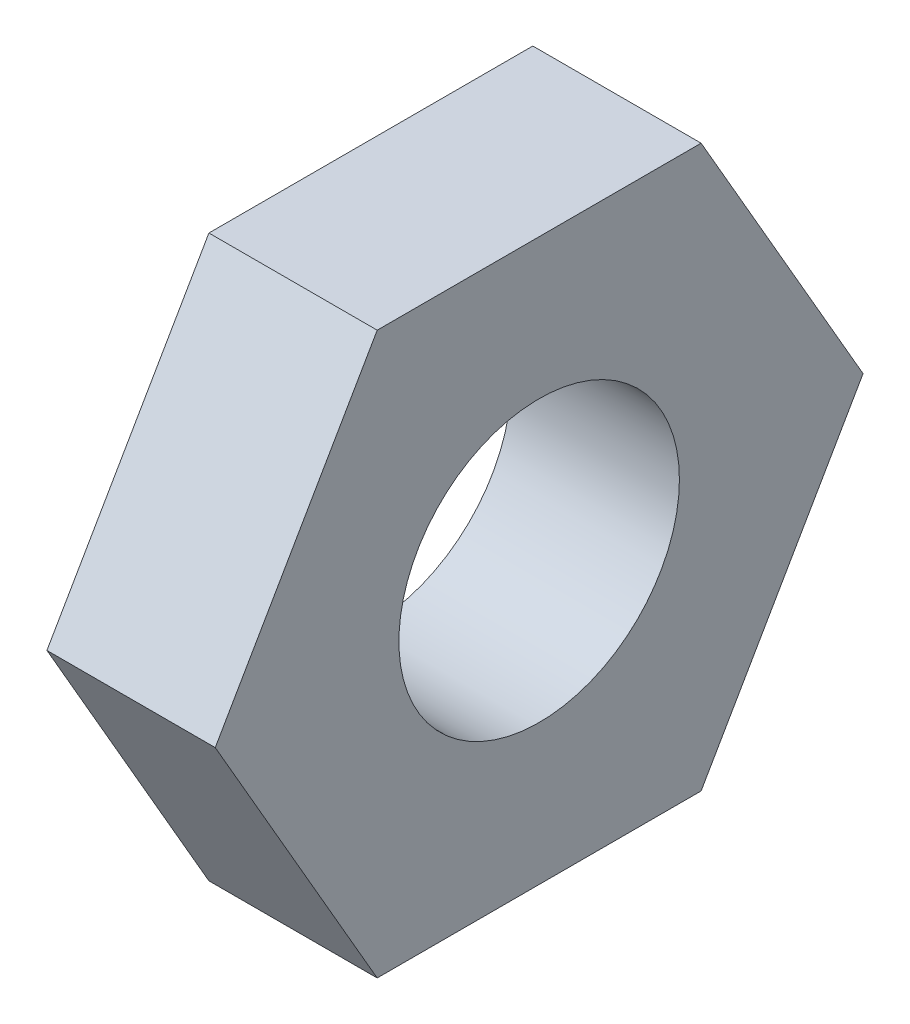
ISO-10303-21;
HEADER;
FILE_DESCRIPTION(('STEP AP214'),'2;1');
FILE_NAME('part.step','',(''),(''),'','','');
FILE_SCHEMA(('AUTOMOTIVE_DESIGN { 1 0 10303 214 1 1 1 1 }'));
ENDSEC;
DATA;
#1=APPLICATION_CONTEXT('core data for automotive mechanical design processes');
#2=APPLICATION_PROTOCOL_DEFINITION('international standard','automotive_design',2000,#1);
#3=PRODUCT_CONTEXT('',#1,'mechanical');
#4=PRODUCT('Part','Part','',(#3));
#5=PRODUCT_RELATED_PRODUCT_CATEGORY('part','',(#4));
#6=PRODUCT_DEFINITION_FORMATION('','',#4);
#7=PRODUCT_DEFINITION_CONTEXT('part definition',#1,'design');
#8=PRODUCT_DEFINITION('design','',#6,#7);
#9=PRODUCT_DEFINITION_SHAPE('','',#8);
#10=(LENGTH_UNIT() NAMED_UNIT(*) SI_UNIT(.MILLI.,.METRE.));
#11=(NAMED_UNIT(*) PLANE_ANGLE_UNIT() SI_UNIT($,.RADIAN.));
#12=(NAMED_UNIT(*) SI_UNIT($,.STERADIAN.) SOLID_ANGLE_UNIT());
#13=UNCERTAINTY_MEASURE_WITH_UNIT(LENGTH_MEASURE(1.E-05),#10,'distance_accuracy_value','');
#14=(GEOMETRIC_REPRESENTATION_CONTEXT(3) GLOBAL_UNCERTAINTY_ASSIGNED_CONTEXT((#13)) GLOBAL_UNIT_ASSIGNED_CONTEXT((#10,
#11,#12)) REPRESENTATION_CONTEXT('',''));
#15=CARTESIAN_POINT('',(0.,0.,0.));
#16=DIRECTION('',(0.,0.,1.));
#17=DIRECTION('',(1.,0.,0.));
#18=AXIS2_PLACEMENT_3D('',#15,#16,#17);
#19=CARTESIAN_POINT('',(1.5,0.,0.));
#20=DIRECTION('',(1.,0.,0.));
#21=DIRECTION('',(0.,0.,-1.));
#22=AXIS2_PLACEMENT_3D('',#19,#20,#21);
#23=PLANE('',#22);
#24=DIRECTION('',(0.,0.866025403784442,-0.499999999999995));
#25=VECTOR('',#24,1.);
#26=CARTESIAN_POINT('',(1.5,-2.49999999999997,-1.44337567297409));
#27=LINE('',#26,#25);
#28=CARTESIAN_POINT('',(1.5,-2.49999999999997,-1.44337567297409));
#29=VERTEX_POINT('',#28);
#30=CARTESIAN_POINT('',(1.5,0.,-2.88675134594812));
#31=VERTEX_POINT('',#30);
#32=EDGE_CURVE('E129',#29,#31,#27,.T.);
#33=ORIENTED_EDGE('',*,*,#32,.T.);
#34=DIRECTION('',(0.,0.866025403784438,0.500000000000001));
#35=VECTOR('',#34,1.);
#36=CARTESIAN_POINT('',(1.5,0.,-2.88675134594812));
#37=LINE('',#36,#35);
#38=CARTESIAN_POINT('',(1.5,2.49999999999999,-1.44337567297405));
#39=VERTEX_POINT('',#38);
#40=EDGE_CURVE('E87',#31,#39,#37,.T.);
#41=ORIENTED_EDGE('',*,*,#40,.T.);
#42=DIRECTION('',(0.,0.,1.));
#43=VECTOR('',#42,1.);
#44=CARTESIAN_POINT('',(1.5,2.49999999999999,-1.44337567297405));
#45=LINE('',#44,#43);
#46=CARTESIAN_POINT('',(1.5,2.49999999999998,1.44337567297407));
#47=VERTEX_POINT('',#46);
#48=EDGE_CURVE('E100',#39,#47,#45,.T.);
#49=ORIENTED_EDGE('',*,*,#48,.T.);
#50=DIRECTION('',(0.,-0.866025403784441,0.499999999999995));
#51=VECTOR('',#50,1.);
#52=CARTESIAN_POINT('',(1.5,2.49999999999998,1.44337567297407));
#53=LINE('',#52,#51);
#54=CARTESIAN_POINT('',(1.5,0.,2.88675134594812));
#55=VERTEX_POINT('',#54);
#56=EDGE_CURVE('E94',#47,#55,#53,.T.);
#57=ORIENTED_EDGE('',*,*,#56,.T.);
#58=DIRECTION('',(0.,-0.866025403784435,-0.500000000000007));
#59=VECTOR('',#58,1.);
#60=CARTESIAN_POINT('',(1.5,0.,2.88675134594812));
#61=LINE('',#60,#59);
#62=CARTESIAN_POINT('',(1.5,-2.5,1.44337567297404));
#63=VERTEX_POINT('',#62);
#64=EDGE_CURVE('E98',#55,#63,#61,.T.);
#65=ORIENTED_EDGE('',*,*,#64,.T.);
#66=DIRECTION('',(0.,0.,-1.));
#67=VECTOR('',#66,1.);
#68=CARTESIAN_POINT('',(1.5,-2.5,1.44337567297404));
#69=LINE('',#68,#67);
#70=EDGE_CURVE('E50',#63,#29,#69,.T.);
#71=ORIENTED_EDGE('',*,*,#70,.T.);
#72=EDGE_LOOP('',(#33,#41,#49,#57,#65,#71));
#73=FACE_BOUND('',#72,.T.);
#74=CARTESIAN_POINT('',(1.5,0.,0.));
#75=DIRECTION('',(1.,0.,0.));
#76=DIRECTION('',(0.,0.,-1.));
#77=AXIS2_PLACEMENT_3D('',#74,#75,#76);
#78=CIRCLE('',#77,1.25);
#79=CARTESIAN_POINT('',(1.5,0.,-1.25));
#80=VERTEX_POINT('',#79);
#81=EDGE_CURVE('E122',#80,#80,#78,.T.);
#82=ORIENTED_EDGE('',*,*,#81,.F.);
#83=EDGE_LOOP('',(#82));
#84=FACE_BOUND('',#83,.T.);
#85=ADVANCED_FACE('F33',(#73,#84),#23,.T.);
#86=CARTESIAN_POINT('',(0.,0.,0.));
#87=DIRECTION('',(1.,0.,0.));
#88=DIRECTION('',(0.,0.,-1.));
#89=AXIS2_PLACEMENT_3D('',#86,#87,#88);
#90=PLANE('',#89);
#91=DIRECTION('',(0.,0.866025403784442,-0.499999999999995));
#92=VECTOR('',#91,1.);
#93=CARTESIAN_POINT('',(0.,-2.49999999999997,-1.44337567297409));
#94=LINE('',#93,#92);
#95=CARTESIAN_POINT('',(0.,-2.49999999999997,-1.44337567297409));
#96=VERTEX_POINT('',#95);
#97=CARTESIAN_POINT('',(0.,0.,-2.88675134594812));
#98=VERTEX_POINT('',#97);
#99=EDGE_CURVE('E118',#96,#98,#94,.T.);
#100=ORIENTED_EDGE('',*,*,#99,.F.);
#101=DIRECTION('',(0.,0.,-1.));
#102=VECTOR('',#101,1.);
#103=CARTESIAN_POINT('',(0.,-2.5,1.44337567297404));
#104=LINE('',#103,#102);
#105=CARTESIAN_POINT('',(0.,-2.5,1.44337567297404));
#106=VERTEX_POINT('',#105);
#107=EDGE_CURVE('E79',#106,#96,#104,.T.);
#108=ORIENTED_EDGE('',*,*,#107,.F.);
#109=DIRECTION('',(0.,-0.866025403784435,-0.500000000000007));
#110=VECTOR('',#109,1.);
#111=CARTESIAN_POINT('',(0.,0.,2.88675134594812));
#112=LINE('',#111,#110);
#113=CARTESIAN_POINT('',(0.,0.,2.88675134594812));
#114=VERTEX_POINT('',#113);
#115=EDGE_CURVE('E73',#114,#106,#112,.T.);
#116=ORIENTED_EDGE('',*,*,#115,.F.);
#117=DIRECTION('',(0.,-0.866025403784441,0.499999999999995));
#118=VECTOR('',#117,1.);
#119=CARTESIAN_POINT('',(0.,2.49999999999998,1.44337567297407));
#120=LINE('',#119,#118);
#121=CARTESIAN_POINT('',(0.,2.49999999999998,1.44337567297407));
#122=VERTEX_POINT('',#121);
#123=EDGE_CURVE('E108',#122,#114,#120,.T.);
#124=ORIENTED_EDGE('',*,*,#123,.F.);
#125=DIRECTION('',(0.,0.,1.));
#126=VECTOR('',#125,1.);
#127=CARTESIAN_POINT('',(0.,2.49999999999999,-1.44337567297405));
#128=LINE('',#127,#126);
#129=CARTESIAN_POINT('',(0.,2.49999999999999,-1.44337567297405));
#130=VERTEX_POINT('',#129);
#131=EDGE_CURVE('E124',#130,#122,#128,.T.);
#132=ORIENTED_EDGE('',*,*,#131,.F.);
#133=DIRECTION('',(0.,0.866025403784438,0.500000000000001));
#134=VECTOR('',#133,1.);
#135=CARTESIAN_POINT('',(0.,0.,-2.88675134594812));
#136=LINE('',#135,#134);
#137=EDGE_CURVE('E121',#98,#130,#136,.T.);
#138=ORIENTED_EDGE('',*,*,#137,.F.);
#139=EDGE_LOOP('',(#100,#108,#116,#124,#132,#138));
#140=FACE_BOUND('',#139,.T.);
#141=CARTESIAN_POINT('',(0.,0.,0.));
#142=DIRECTION('',(1.,0.,0.));
#143=DIRECTION('',(0.,0.,-1.));
#144=AXIS2_PLACEMENT_3D('',#141,#142,#143);
#145=CIRCLE('',#144,1.25);
#146=CARTESIAN_POINT('',(0.,0.,-1.25));
#147=VERTEX_POINT('',#146);
#148=EDGE_CURVE('E222',#147,#147,#145,.T.);
#149=ORIENTED_EDGE('',*,*,#148,.T.);
#150=EDGE_LOOP('',(#149));
#151=FACE_BOUND('',#150,.T.);
#152=ADVANCED_FACE('F138',(#140,#151),#90,.F.);
#153=CARTESIAN_POINT('',(1.5,-2.49999999999997,-1.44337567297409));
#154=DIRECTION('',(0.,0.499999999999995,0.866025403784441));
#155=DIRECTION('',(0.,-0.866025403784442,0.499999999999995));
#156=AXIS2_PLACEMENT_3D('',#153,#154,#155);
#157=PLANE('',#156);
#158=ORIENTED_EDGE('',*,*,#99,.T.);
#159=DIRECTION('',(-1.,0.,0.));
#160=VECTOR('',#159,1.);
#161=CARTESIAN_POINT('',(1.5,0.,-2.88675134594812));
#162=LINE('',#161,#160);
#163=EDGE_CURVE('E11',#31,#98,#162,.T.);
#164=ORIENTED_EDGE('',*,*,#163,.F.);
#165=ORIENTED_EDGE('',*,*,#32,.F.);
#166=DIRECTION('',(-1.,0.,0.));
#167=VECTOR('',#166,1.);
#168=CARTESIAN_POINT('',(1.5,-2.49999999999997,-1.44337567297409));
#169=LINE('',#168,#167);
#170=EDGE_CURVE('E114',#29,#96,#169,.T.);
#171=ORIENTED_EDGE('',*,*,#170,.T.);
#172=EDGE_LOOP('',(#158,#164,#165,#171));
#173=FACE_BOUND('',#172,.T.);
#174=ADVANCED_FACE('F35',(#173),#157,.F.);
#175=CARTESIAN_POINT('',(1.5,0.,-2.88675134594812));
#176=DIRECTION('',(0.,-0.500000000000001,0.866025403784438));
#177=DIRECTION('',(0.,-0.866025403784438,-0.500000000000001));
#178=AXIS2_PLACEMENT_3D('',#175,#176,#177);
#179=PLANE('',#178);
#180=ORIENTED_EDGE('',*,*,#137,.T.);
#181=DIRECTION('',(-1.,0.,0.));
#182=VECTOR('',#181,1.);
#183=CARTESIAN_POINT('',(1.5,2.49999999999999,-1.44337567297405));
#184=LINE('',#183,#182);
#185=EDGE_CURVE('E42',#39,#130,#184,.T.);
#186=ORIENTED_EDGE('',*,*,#185,.F.);
#187=ORIENTED_EDGE('',*,*,#40,.F.);
#188=ORIENTED_EDGE('',*,*,#163,.T.);
#189=EDGE_LOOP('',(#180,#186,#187,#188));
#190=FACE_BOUND('',#189,.T.);
#191=ADVANCED_FACE('F163',(#190),#179,.F.);
#192=CARTESIAN_POINT('',(1.5,2.49999999999999,-1.44337567297405));
#193=DIRECTION('',(0.,-1.,0.));
#194=DIRECTION('',(0.,0.,-1.));
#195=AXIS2_PLACEMENT_3D('',#192,#193,#194);
#196=PLANE('',#195);
#197=ORIENTED_EDGE('',*,*,#131,.T.);
#198=DIRECTION('',(-1.,0.,0.));
#199=VECTOR('',#198,1.);
#200=CARTESIAN_POINT('',(1.5,2.49999999999998,1.44337567297407));
#201=LINE('',#200,#199);
#202=EDGE_CURVE('E109',#47,#122,#201,.T.);
#203=ORIENTED_EDGE('',*,*,#202,.F.);
#204=ORIENTED_EDGE('',*,*,#48,.F.);
#205=ORIENTED_EDGE('',*,*,#185,.T.);
#206=EDGE_LOOP('',(#197,#203,#204,#205));
#207=FACE_BOUND('',#206,.T.);
#208=ADVANCED_FACE('F135',(#207),#196,.F.);
#209=CARTESIAN_POINT('',(1.5,2.49999999999998,1.44337567297407));
#210=DIRECTION('',(0.,-0.499999999999995,-0.866025403784441));
#211=DIRECTION('',(0.,0.866025403784442,-0.499999999999995));
#212=AXIS2_PLACEMENT_3D('',#209,#210,#211);
#213=PLANE('',#212);
#214=ORIENTED_EDGE('',*,*,#123,.T.);
#215=DIRECTION('',(-1.,0.,0.));
#216=VECTOR('',#215,1.);
#217=CARTESIAN_POINT('',(1.5,0.,2.88675134594812));
#218=LINE('',#217,#216);
#219=EDGE_CURVE('E105',#55,#114,#218,.T.);
#220=ORIENTED_EDGE('',*,*,#219,.F.);
#221=ORIENTED_EDGE('',*,*,#56,.F.);
#222=ORIENTED_EDGE('',*,*,#202,.T.);
#223=EDGE_LOOP('',(#214,#220,#221,#222));
#224=FACE_BOUND('',#223,.T.);
#225=ADVANCED_FACE('F106',(#224),#213,.F.);
#226=CARTESIAN_POINT('',(1.5,0.,2.88675134594812));
#227=DIRECTION('',(0.,0.500000000000007,-0.866025403784434));
#228=DIRECTION('',(0.,0.866025403784435,0.500000000000007));
#229=AXIS2_PLACEMENT_3D('',#226,#227,#228);
#230=PLANE('',#229);
#231=ORIENTED_EDGE('',*,*,#115,.T.);
#232=DIRECTION('',(-1.,0.,0.));
#233=VECTOR('',#232,1.);
#234=CARTESIAN_POINT('',(1.5,-2.5,1.44337567297404));
#235=LINE('',#234,#233);
#236=EDGE_CURVE('E110',#63,#106,#235,.T.);
#237=ORIENTED_EDGE('',*,*,#236,.F.);
#238=ORIENTED_EDGE('',*,*,#64,.F.);
#239=ORIENTED_EDGE('',*,*,#219,.T.);
#240=EDGE_LOOP('',(#231,#237,#238,#239));
#241=FACE_BOUND('',#240,.T.);
#242=ADVANCED_FACE('F112',(#241),#230,.F.);
#243=CARTESIAN_POINT('',(1.5,-2.5,1.44337567297404));
#244=DIRECTION('',(0.,1.,0.));
#245=DIRECTION('',(0.,0.,1.));
#246=AXIS2_PLACEMENT_3D('',#243,#244,#245);
#247=PLANE('',#246);
#248=ORIENTED_EDGE('',*,*,#107,.T.);
#249=ORIENTED_EDGE('',*,*,#170,.F.);
#250=ORIENTED_EDGE('',*,*,#70,.F.);
#251=ORIENTED_EDGE('',*,*,#236,.T.);
#252=EDGE_LOOP('',(#248,#249,#250,#251));
#253=FACE_BOUND('',#252,.T.);
#254=ADVANCED_FACE('F143',(#253),#247,.F.);
#255=CARTESIAN_POINT('',(1.5,0.,0.));
#256=DIRECTION('',(-1.,0.,0.));
#257=DIRECTION('',(0.,0.,1.));
#258=AXIS2_PLACEMENT_3D('',#255,#256,#257);
#259=CYLINDRICAL_SURFACE('',#258,1.25);
#260=ORIENTED_EDGE('',*,*,#81,.T.);
#261=EDGE_LOOP('',(#260));
#262=FACE_BOUND('',#261,.T.);
#263=ORIENTED_EDGE('',*,*,#148,.F.);
#264=EDGE_LOOP('',(#263));
#265=FACE_BOUND('',#264,.T.);
#266=ADVANCED_FACE('F145',(#262,#265),#259,.F.);
#267=CLOSED_SHELL('',(#85,#152,#174,#191,#208,#225,#242,#254,#266));
#268=MANIFOLD_SOLID_BREP('B2',#267);
#269=ADVANCED_BREP_SHAPE_REPRESENTATION('',(#18,#268),#14);
#270=SHAPE_DEFINITION_REPRESENTATION(#9,#269);
ENDSEC;
END-ISO-10303-21;
